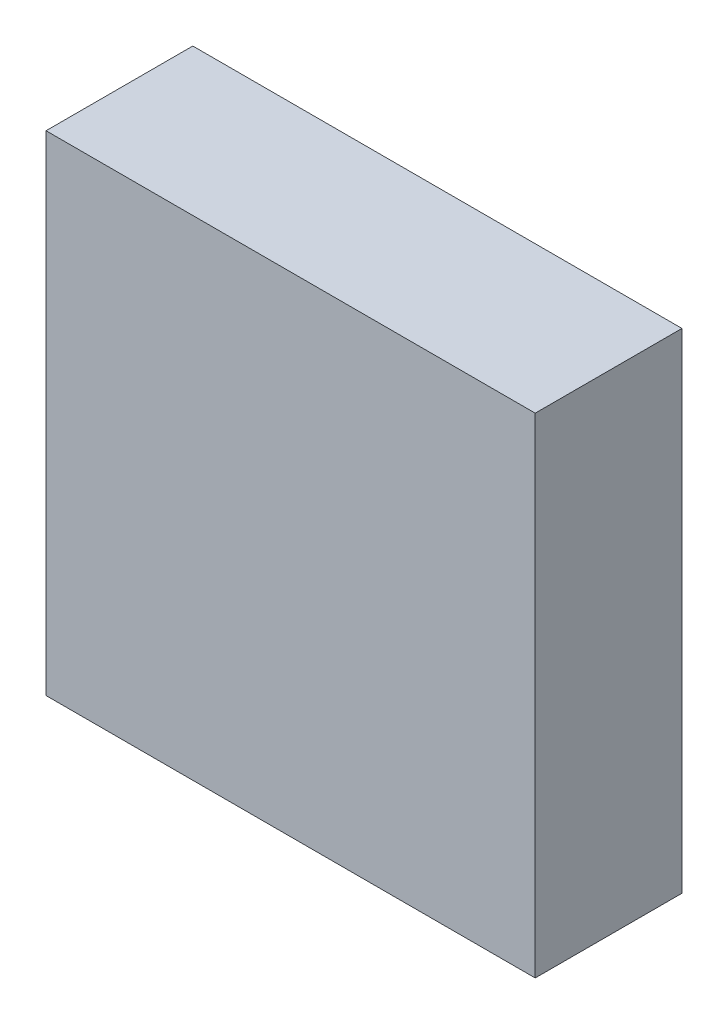
ISO-10303-21;
HEADER;
FILE_DESCRIPTION(('STEP AP214'),'2;1');
FILE_NAME('part.step','',(''),(''),'','','');
FILE_SCHEMA(('AUTOMOTIVE_DESIGN { 1 0 10303 214 1 1 1 1 }'));
ENDSEC;
DATA;
#1=APPLICATION_CONTEXT('core data for automotive mechanical design processes');
#2=APPLICATION_PROTOCOL_DEFINITION('international standard','automotive_design',2000,#1);
#3=PRODUCT_CONTEXT('',#1,'mechanical');
#4=PRODUCT('Part','Part','',(#3));
#5=PRODUCT_RELATED_PRODUCT_CATEGORY('part','',(#4));
#6=PRODUCT_DEFINITION_FORMATION('','',#4);
#7=PRODUCT_DEFINITION_CONTEXT('part definition',#1,'design');
#8=PRODUCT_DEFINITION('design','',#6,#7);
#9=PRODUCT_DEFINITION_SHAPE('','',#8);
#10=(LENGTH_UNIT() NAMED_UNIT(*) SI_UNIT(.MILLI.,.METRE.));
#11=(NAMED_UNIT(*) PLANE_ANGLE_UNIT() SI_UNIT($,.RADIAN.));
#12=(NAMED_UNIT(*) SI_UNIT($,.STERADIAN.) SOLID_ANGLE_UNIT());
#13=UNCERTAINTY_MEASURE_WITH_UNIT(LENGTH_MEASURE(1.E-05),#10,'distance_accuracy_value','');
#14=(GEOMETRIC_REPRESENTATION_CONTEXT(3) GLOBAL_UNCERTAINTY_ASSIGNED_CONTEXT((#13)) GLOBAL_UNIT_ASSIGNED_CONTEXT((#10,
#11,#12)) REPRESENTATION_CONTEXT('',''));
#15=CARTESIAN_POINT('',(0.,0.,0.));
#16=DIRECTION('',(0.,0.,1.));
#17=DIRECTION('',(1.,0.,0.));
#18=AXIS2_PLACEMENT_3D('',#15,#16,#17);
#19=CARTESIAN_POINT('',(0.,0.,9.6));
#20=DIRECTION('',(0.,1.,0.));
#21=DIRECTION('',(0.,0.,1.));
#22=AXIS2_PLACEMENT_3D('',#19,#20,#21);
#23=PLANE('',#22);
#24=DIRECTION('',(1.,0.,0.));
#25=VECTOR('',#24,1.);
#26=CARTESIAN_POINT('',(0.,0.,0.));
#27=LINE('',#26,#25);
#28=CARTESIAN_POINT('',(-32.,0.,0.));
#29=VERTEX_POINT('',#28);
#30=CARTESIAN_POINT('',(0.,0.,0.));
#31=VERTEX_POINT('',#30);
#32=EDGE_CURVE('E107',#29,#31,#27,.T.);
#33=ORIENTED_EDGE('',*,*,#32,.T.);
#34=DIRECTION('',(0.,0.,-1.));
#35=VECTOR('',#34,1.);
#36=CARTESIAN_POINT('',(0.,0.,9.6));
#37=LINE('',#36,#35);
#38=CARTESIAN_POINT('',(0.,0.,9.6));
#39=VERTEX_POINT('',#38);
#40=EDGE_CURVE('E11',#39,#31,#37,.T.);
#41=ORIENTED_EDGE('',*,*,#40,.F.);
#42=DIRECTION('',(1.,0.,0.));
#43=VECTOR('',#42,1.);
#44=CARTESIAN_POINT('',(0.,0.,9.6));
#45=LINE('',#44,#43);
#46=CARTESIAN_POINT('',(-32.,0.,9.6));
#47=VERTEX_POINT('',#46);
#48=EDGE_CURVE('E95',#47,#39,#45,.T.);
#49=ORIENTED_EDGE('',*,*,#48,.F.);
#50=DIRECTION('',(0.,0.,-1.));
#51=VECTOR('',#50,1.);
#52=CARTESIAN_POINT('',(-32.,0.,9.6));
#53=LINE('',#52,#51);
#54=EDGE_CURVE('E103',#47,#29,#53,.T.);
#55=ORIENTED_EDGE('',*,*,#54,.T.);
#56=EDGE_LOOP('',(#33,#41,#49,#55));
#57=FACE_BOUND('',#56,.T.);
#58=ADVANCED_FACE('F44',(#57),#23,.F.);
#59=CARTESIAN_POINT('',(0.,0.,9.6));
#60=DIRECTION('',(-1.,0.,0.));
#61=DIRECTION('',(0.,0.,1.));
#62=AXIS2_PLACEMENT_3D('',#59,#60,#61);
#63=PLANE('',#62);
#64=DIRECTION('',(0.,1.,0.));
#65=VECTOR('',#64,1.);
#66=CARTESIAN_POINT('',(0.,0.,0.));
#67=LINE('',#66,#65);
#68=CARTESIAN_POINT('',(0.,32.,0.));
#69=VERTEX_POINT('',#68);
#70=EDGE_CURVE('E99',#31,#69,#67,.T.);
#71=ORIENTED_EDGE('',*,*,#70,.T.);
#72=DIRECTION('',(0.,0.,-1.));
#73=VECTOR('',#72,1.);
#74=CARTESIAN_POINT('',(0.,32.,9.6));
#75=LINE('',#74,#73);
#76=CARTESIAN_POINT('',(0.,32.,9.6));
#77=VERTEX_POINT('',#76);
#78=EDGE_CURVE('E52',#77,#69,#75,.T.);
#79=ORIENTED_EDGE('',*,*,#78,.F.);
#80=DIRECTION('',(0.,1.,0.));
#81=VECTOR('',#80,1.);
#82=CARTESIAN_POINT('',(0.,0.,9.6));
#83=LINE('',#82,#81);
#84=EDGE_CURVE('E90',#39,#77,#83,.T.);
#85=ORIENTED_EDGE('',*,*,#84,.F.);
#86=ORIENTED_EDGE('',*,*,#40,.T.);
#87=EDGE_LOOP('',(#71,#79,#85,#86));
#88=FACE_BOUND('',#87,.T.);
#89=ADVANCED_FACE('F98',(#88),#63,.F.);
#90=CARTESIAN_POINT('',(0.,32.,9.6));
#91=DIRECTION('',(0.,-1.,0.));
#92=DIRECTION('',(0.,0.,-1.));
#93=AXIS2_PLACEMENT_3D('',#90,#91,#92);
#94=PLANE('',#93);
#95=DIRECTION('',(-1.,0.,0.));
#96=VECTOR('',#95,1.);
#97=CARTESIAN_POINT('',(0.,32.,0.));
#98=LINE('',#97,#96);
#99=CARTESIAN_POINT('',(-32.,32.,0.));
#100=VERTEX_POINT('',#99);
#101=EDGE_CURVE('E77',#69,#100,#98,.T.);
#102=ORIENTED_EDGE('',*,*,#101,.T.);
#103=DIRECTION('',(0.,0.,-1.));
#104=VECTOR('',#103,1.);
#105=CARTESIAN_POINT('',(-32.,32.,9.6));
#106=LINE('',#105,#104);
#107=CARTESIAN_POINT('',(-32.,32.,9.6));
#108=VERTEX_POINT('',#107);
#109=EDGE_CURVE('E100',#108,#100,#106,.T.);
#110=ORIENTED_EDGE('',*,*,#109,.F.);
#111=DIRECTION('',(-1.,0.,0.));
#112=VECTOR('',#111,1.);
#113=CARTESIAN_POINT('',(0.,32.,9.6));
#114=LINE('',#113,#112);
#115=EDGE_CURVE('E93',#77,#108,#114,.T.);
#116=ORIENTED_EDGE('',*,*,#115,.F.);
#117=ORIENTED_EDGE('',*,*,#78,.T.);
#118=EDGE_LOOP('',(#102,#110,#116,#117));
#119=FACE_BOUND('',#118,.T.);
#120=ADVANCED_FACE('F101',(#119),#94,.F.);
#121=CARTESIAN_POINT('',(-32.,0.,9.6));
#122=DIRECTION('',(1.,0.,0.));
#123=DIRECTION('',(0.,0.,-1.));
#124=AXIS2_PLACEMENT_3D('',#121,#122,#123);
#125=PLANE('',#124);
#126=DIRECTION('',(0.,-1.,0.));
#127=VECTOR('',#126,1.);
#128=CARTESIAN_POINT('',(-32.,0.,0.));
#129=LINE('',#128,#127);
#130=EDGE_CURVE('E83',#100,#29,#129,.T.);
#131=ORIENTED_EDGE('',*,*,#130,.T.);
#132=ORIENTED_EDGE('',*,*,#54,.F.);
#133=DIRECTION('',(0.,-1.,0.));
#134=VECTOR('',#133,1.);
#135=CARTESIAN_POINT('',(-32.,0.,9.6));
#136=LINE('',#135,#134);
#137=EDGE_CURVE('E60',#108,#47,#136,.T.);
#138=ORIENTED_EDGE('',*,*,#137,.F.);
#139=ORIENTED_EDGE('',*,*,#109,.T.);
#140=EDGE_LOOP('',(#131,#132,#138,#139));
#141=FACE_BOUND('',#140,.T.);
#142=ADVANCED_FACE('F114',(#141),#125,.F.);
#143=CARTESIAN_POINT('',(0.,0.,9.6));
#144=DIRECTION('',(0.,0.,-1.));
#145=DIRECTION('',(-1.,0.,0.));
#146=AXIS2_PLACEMENT_3D('',#143,#144,#145);
#147=PLANE('',#146);
#148=ORIENTED_EDGE('',*,*,#48,.T.);
#149=ORIENTED_EDGE('',*,*,#84,.T.);
#150=ORIENTED_EDGE('',*,*,#115,.T.);
#151=ORIENTED_EDGE('',*,*,#137,.T.);
#152=EDGE_LOOP('',(#148,#149,#150,#151));
#153=FACE_BOUND('',#152,.T.);
#154=ADVANCED_FACE('F91',(#153),#147,.F.);
#155=CARTESIAN_POINT('',(0.,0.,0.));
#156=DIRECTION('',(0.,0.,-1.));
#157=DIRECTION('',(-1.,0.,0.));
#158=AXIS2_PLACEMENT_3D('',#155,#156,#157);
#159=PLANE('',#158);
#160=ORIENTED_EDGE('',*,*,#32,.F.);
#161=ORIENTED_EDGE('',*,*,#130,.F.);
#162=ORIENTED_EDGE('',*,*,#101,.F.);
#163=ORIENTED_EDGE('',*,*,#70,.F.);
#164=EDGE_LOOP('',(#160,#161,#162,#163));
#165=FACE_BOUND('',#164,.T.);
#166=ADVANCED_FACE('F117',(#165),#159,.T.);
#167=CLOSED_SHELL('',(#58,#89,#120,#142,#154,#166));
#168=MANIFOLD_SOLID_BREP('B2',#167);
#169=ADVANCED_BREP_SHAPE_REPRESENTATION('',(#18,#168),#14);
#170=SHAPE_DEFINITION_REPRESENTATION(#9,#169);
ENDSEC;
END-ISO-10303-21;
